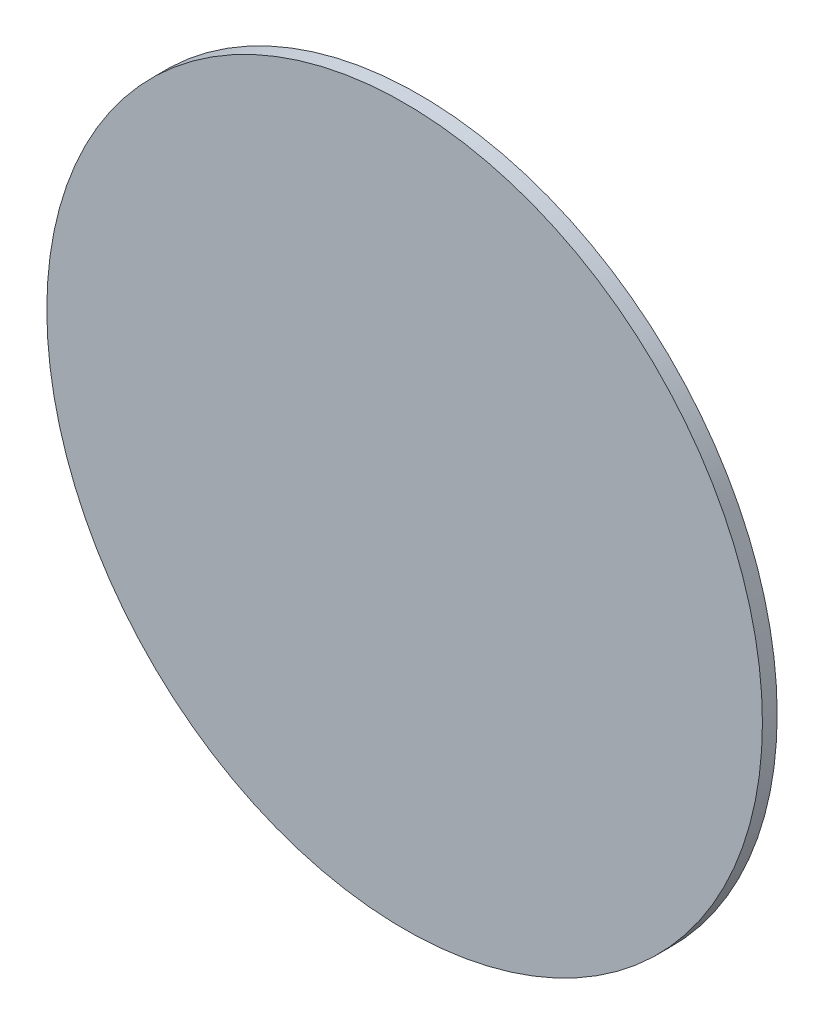
ISO-10303-21;
HEADER;
FILE_DESCRIPTION(('STEP AP214'),'2;1');
FILE_NAME('part.step','',(''),(''),'','','');
FILE_SCHEMA(('AUTOMOTIVE_DESIGN { 1 0 10303 214 1 1 1 1 }'));
ENDSEC;
DATA;
#1=APPLICATION_CONTEXT('core data for automotive mechanical design processes');
#2=APPLICATION_PROTOCOL_DEFINITION('international standard','automotive_design',2000,#1);
#3=PRODUCT_CONTEXT('',#1,'mechanical');
#4=PRODUCT('Part','Part','',(#3));
#5=PRODUCT_RELATED_PRODUCT_CATEGORY('part','',(#4));
#6=PRODUCT_DEFINITION_FORMATION('','',#4);
#7=PRODUCT_DEFINITION_CONTEXT('part definition',#1,'design');
#8=PRODUCT_DEFINITION('design','',#6,#7);
#9=PRODUCT_DEFINITION_SHAPE('','',#8);
#10=(LENGTH_UNIT() NAMED_UNIT(*) SI_UNIT(.MILLI.,.METRE.));
#11=(NAMED_UNIT(*) PLANE_ANGLE_UNIT() SI_UNIT($,.RADIAN.));
#12=(NAMED_UNIT(*) SI_UNIT($,.STERADIAN.) SOLID_ANGLE_UNIT());
#13=UNCERTAINTY_MEASURE_WITH_UNIT(LENGTH_MEASURE(1.E-05),#10,'distance_accuracy_value','');
#14=(GEOMETRIC_REPRESENTATION_CONTEXT(3) GLOBAL_UNCERTAINTY_ASSIGNED_CONTEXT((#13)) GLOBAL_UNIT_ASSIGNED_CONTEXT((#10,
#11,#12)) REPRESENTATION_CONTEXT('',''));
#15=CARTESIAN_POINT('',(0.,0.,0.));
#16=DIRECTION('',(0.,0.,1.));
#17=DIRECTION('',(1.,0.,0.));
#18=AXIS2_PLACEMENT_3D('',#15,#16,#17);
#19=CARTESIAN_POINT('',(0.,0.,0.4));
#20=DIRECTION('',(0.,0.,-1.));
#21=DIRECTION('',(-1.,0.,0.));
#22=AXIS2_PLACEMENT_3D('',#19,#20,#21);
#23=CYLINDRICAL_SURFACE('',#22,9.7);
#24=CARTESIAN_POINT('',(0.,0.,0.4));
#25=DIRECTION('',(0.,0.,1.));
#26=DIRECTION('',(1.,0.,0.));
#27=AXIS2_PLACEMENT_3D('',#24,#25,#26);
#28=CIRCLE('',#27,9.7);
#29=CARTESIAN_POINT('',(9.7,0.,0.4));
#30=VERTEX_POINT('',#29);
#31=EDGE_CURVE('E10',#30,#30,#28,.T.);
#32=ORIENTED_EDGE('',*,*,#31,.F.);
#33=EDGE_LOOP('',(#32));
#34=FACE_BOUND('',#33,.T.);
#35=CARTESIAN_POINT('',(0.,0.,0.));
#36=DIRECTION('',(0.,0.,1.));
#37=DIRECTION('',(1.,0.,0.));
#38=AXIS2_PLACEMENT_3D('',#35,#36,#37);
#39=CIRCLE('',#38,9.7);
#40=CARTESIAN_POINT('',(9.7,0.,0.));
#41=VERTEX_POINT('',#40);
#42=EDGE_CURVE('E34',#41,#41,#39,.T.);
#43=ORIENTED_EDGE('',*,*,#42,.T.);
#44=EDGE_LOOP('',(#43));
#45=FACE_BOUND('',#44,.T.);
#46=ADVANCED_FACE('F31',(#34,#45),#23,.T.);
#47=CARTESIAN_POINT('',(0.,0.,0.4));
#48=DIRECTION('',(0.,0.,1.));
#49=DIRECTION('',(1.,0.,0.));
#50=AXIS2_PLACEMENT_3D('',#47,#48,#49);
#51=PLANE('',#50);
#52=ORIENTED_EDGE('',*,*,#31,.T.);
#53=EDGE_LOOP('',(#52));
#54=FACE_BOUND('',#53,.T.);
#55=ADVANCED_FACE('F46',(#54),#51,.T.);
#56=CARTESIAN_POINT('',(0.,0.,0.));
#57=DIRECTION('',(0.,0.,1.));
#58=DIRECTION('',(1.,0.,0.));
#59=AXIS2_PLACEMENT_3D('',#56,#57,#58);
#60=PLANE('',#59);
#61=ORIENTED_EDGE('',*,*,#42,.F.);
#62=EDGE_LOOP('',(#61));
#63=FACE_BOUND('',#62,.T.);
#64=ADVANCED_FACE('F44',(#63),#60,.F.);
#65=CLOSED_SHELL('',(#46,#55,#64));
#66=MANIFOLD_SOLID_BREP('B2',#65);
#67=ADVANCED_BREP_SHAPE_REPRESENTATION('',(#18,#66),#14);
#68=SHAPE_DEFINITION_REPRESENTATION(#9,#67);
ENDSEC;
END-ISO-10303-21;
